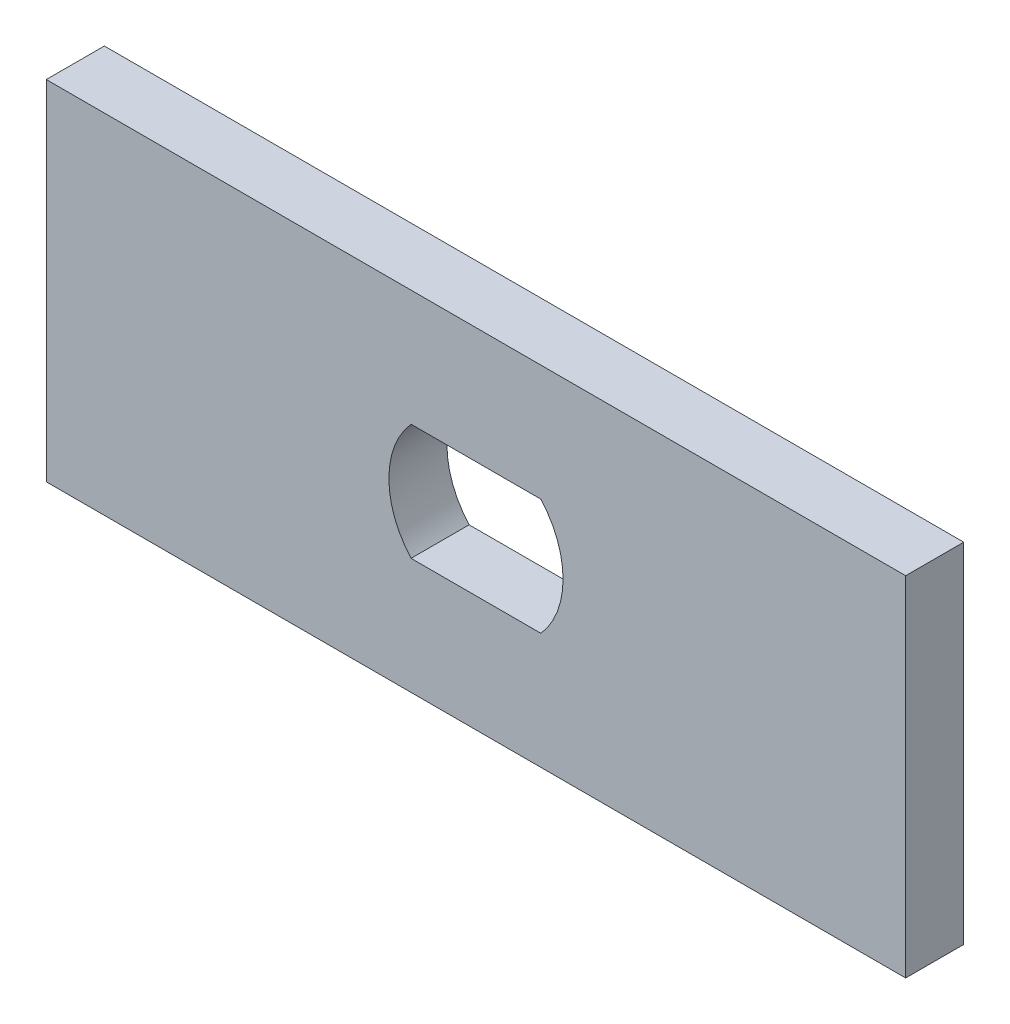
ISO-10303-21;
HEADER;
FILE_DESCRIPTION(('STEP AP214'),'2;1');
FILE_NAME('part.step','',(''),(''),'','','');
FILE_SCHEMA(('AUTOMOTIVE_DESIGN { 1 0 10303 214 1 1 1 1 }'));
ENDSEC;
DATA;
#1=APPLICATION_CONTEXT('core data for automotive mechanical design processes');
#2=APPLICATION_PROTOCOL_DEFINITION('international standard','automotive_design',2000,#1);
#3=PRODUCT_CONTEXT('',#1,'mechanical');
#4=PRODUCT('Part','Part','',(#3));
#5=PRODUCT_RELATED_PRODUCT_CATEGORY('part','',(#4));
#6=PRODUCT_DEFINITION_FORMATION('','',#4);
#7=PRODUCT_DEFINITION_CONTEXT('part definition',#1,'design');
#8=PRODUCT_DEFINITION('design','',#6,#7);
#9=PRODUCT_DEFINITION_SHAPE('','',#8);
#10=(LENGTH_UNIT() NAMED_UNIT(*) SI_UNIT(.MILLI.,.METRE.));
#11=(NAMED_UNIT(*) PLANE_ANGLE_UNIT() SI_UNIT($,.RADIAN.));
#12=(NAMED_UNIT(*) SI_UNIT($,.STERADIAN.) SOLID_ANGLE_UNIT());
#13=UNCERTAINTY_MEASURE_WITH_UNIT(LENGTH_MEASURE(1.E-05),#10,'distance_accuracy_value','');
#14=(GEOMETRIC_REPRESENTATION_CONTEXT(3) GLOBAL_UNCERTAINTY_ASSIGNED_CONTEXT((#13)) GLOBAL_UNIT_ASSIGNED_CONTEXT((#10,
#11,#12)) REPRESENTATION_CONTEXT('',''));
#15=CARTESIAN_POINT('',(0.,0.,0.));
#16=DIRECTION('',(0.,0.,1.));
#17=DIRECTION('',(1.,0.,0.));
#18=AXIS2_PLACEMENT_3D('',#15,#16,#17);
#19=CARTESIAN_POINT('',(0.,0.,6.35));
#20=DIRECTION('',(0.,0.,1.));
#21=DIRECTION('',(1.,0.,0.));
#22=AXIS2_PLACEMENT_3D('',#19,#20,#21);
#23=PLANE('',#22);
#24=DIRECTION('',(0.,1.,0.));
#25=VECTOR('',#24,1.);
#26=CARTESIAN_POINT('',(46.99,19.05,6.35));
#27=LINE('',#26,#25);
#28=CARTESIAN_POINT('',(46.99,-19.05,6.35));
#29=VERTEX_POINT('',#28);
#30=CARTESIAN_POINT('',(46.99,19.05,6.35));
#31=VERTEX_POINT('',#30);
#32=EDGE_CURVE('E163',#29,#31,#27,.T.);
#33=ORIENTED_EDGE('',*,*,#32,.T.);
#34=DIRECTION('',(-1.,0.,0.));
#35=VECTOR('',#34,1.);
#36=CARTESIAN_POINT('',(-46.99,19.05,6.35));
#37=LINE('',#36,#35);
#38=CARTESIAN_POINT('',(-46.99,19.05,6.35));
#39=VERTEX_POINT('',#38);
#40=EDGE_CURVE('E166',#31,#39,#37,.T.);
#41=ORIENTED_EDGE('',*,*,#40,.T.);
#42=DIRECTION('',(0.,-1.,0.));
#43=VECTOR('',#42,1.);
#44=CARTESIAN_POINT('',(-46.99,19.05,6.35));
#45=LINE('',#44,#43);
#46=CARTESIAN_POINT('',(-46.99,-19.05,6.35));
#47=VERTEX_POINT('',#46);
#48=EDGE_CURVE('E170',#39,#47,#45,.T.);
#49=ORIENTED_EDGE('',*,*,#48,.T.);
#50=DIRECTION('',(1.,0.,0.));
#51=VECTOR('',#50,1.);
#52=CARTESIAN_POINT('',(-46.99,-19.05,6.35));
#53=LINE('',#52,#51);
#54=EDGE_CURVE('E173',#47,#29,#53,.T.);
#55=ORIENTED_EDGE('',*,*,#54,.T.);
#56=EDGE_LOOP('',(#33,#41,#49,#55));
#57=FACE_BOUND('',#56,.T.);
#58=DIRECTION('',(-1.,0.,0.));
#59=VECTOR('',#58,1.);
#60=CARTESIAN_POINT('',(-7.09951582856185,6.35,6.35));
#61=LINE('',#60,#59);
#62=CARTESIAN_POINT('',(7.09951582856183,6.35,6.35));
#63=VERTEX_POINT('',#62);
#64=CARTESIAN_POINT('',(-7.09951582856185,6.35,6.35));
#65=VERTEX_POINT('',#64);
#66=EDGE_CURVE('E124',#63,#65,#61,.T.);
#67=ORIENTED_EDGE('',*,*,#66,.F.);
#68=CARTESIAN_POINT('',(0.,0.,6.35));
#69=DIRECTION('',(0.,0.,1.));
#70=DIRECTION('',(1.,0.,0.));
#71=AXIS2_PLACEMENT_3D('',#68,#69,#70);
#72=CIRCLE('',#71,9.52499999999999);
#73=CARTESIAN_POINT('',(7.09951582856183,-6.35,6.35));
#74=VERTEX_POINT('',#73);
#75=EDGE_CURVE('E115',#74,#63,#72,.T.);
#76=ORIENTED_EDGE('',*,*,#75,.F.);
#77=DIRECTION('',(1.,0.,0.));
#78=VECTOR('',#77,1.);
#79=CARTESIAN_POINT('',(-7.09951582856185,-6.35,6.35));
#80=LINE('',#79,#78);
#81=CARTESIAN_POINT('',(-7.09951582856184,-6.35,6.35));
#82=VERTEX_POINT('',#81);
#83=EDGE_CURVE('E142',#82,#74,#80,.T.);
#84=ORIENTED_EDGE('',*,*,#83,.F.);
#85=CARTESIAN_POINT('',(0.,0.,6.35));
#86=DIRECTION('',(0.,0.,1.));
#87=DIRECTION('',(1.,0.,0.));
#88=AXIS2_PLACEMENT_3D('',#85,#86,#87);
#89=CIRCLE('',#88,9.52500000000001);
#90=EDGE_CURVE('E137',#65,#82,#89,.T.);
#91=ORIENTED_EDGE('',*,*,#90,.F.);
#92=EDGE_LOOP('',(#67,#76,#84,#91));
#93=FACE_BOUND('',#92,.T.);
#94=ADVANCED_FACE('F40',(#57,#93),#23,.T.);
#95=CARTESIAN_POINT('',(0.,0.,0.));
#96=DIRECTION('',(0.,0.,1.));
#97=DIRECTION('',(1.,0.,0.));
#98=AXIS2_PLACEMENT_3D('',#95,#96,#97);
#99=PLANE('',#98);
#100=DIRECTION('',(0.,1.,0.));
#101=VECTOR('',#100,1.);
#102=CARTESIAN_POINT('',(46.99,19.05,0.));
#103=LINE('',#102,#101);
#104=CARTESIAN_POINT('',(46.99,-19.05,0.));
#105=VERTEX_POINT('',#104);
#106=CARTESIAN_POINT('',(46.99,19.05,0.));
#107=VERTEX_POINT('',#106);
#108=EDGE_CURVE('E133',#105,#107,#103,.T.);
#109=ORIENTED_EDGE('',*,*,#108,.F.);
#110=DIRECTION('',(1.,0.,0.));
#111=VECTOR('',#110,1.);
#112=CARTESIAN_POINT('',(-46.99,-19.05,0.));
#113=LINE('',#112,#111);
#114=CARTESIAN_POINT('',(-46.99,-19.05,0.));
#115=VERTEX_POINT('',#114);
#116=EDGE_CURVE('E167',#115,#105,#113,.T.);
#117=ORIENTED_EDGE('',*,*,#116,.F.);
#118=DIRECTION('',(0.,-1.,0.));
#119=VECTOR('',#118,1.);
#120=CARTESIAN_POINT('',(-46.99,19.05,0.));
#121=LINE('',#120,#119);
#122=CARTESIAN_POINT('',(-46.99,19.05,0.));
#123=VERTEX_POINT('',#122);
#124=EDGE_CURVE('E182',#123,#115,#121,.T.);
#125=ORIENTED_EDGE('',*,*,#124,.F.);
#126=DIRECTION('',(-1.,0.,0.));
#127=VECTOR('',#126,1.);
#128=CARTESIAN_POINT('',(-46.99,19.05,0.));
#129=LINE('',#128,#127);
#130=EDGE_CURVE('E179',#107,#123,#129,.T.);
#131=ORIENTED_EDGE('',*,*,#130,.F.);
#132=EDGE_LOOP('',(#109,#117,#125,#131));
#133=FACE_BOUND('',#132,.T.);
#134=CARTESIAN_POINT('',(0.,0.,0.));
#135=DIRECTION('',(0.,0.,1.));
#136=DIRECTION('',(1.,0.,0.));
#137=AXIS2_PLACEMENT_3D('',#134,#135,#136);
#138=CIRCLE('',#137,9.52499999999999);
#139=CARTESIAN_POINT('',(7.09951582856183,-6.35,0.));
#140=VERTEX_POINT('',#139);
#141=CARTESIAN_POINT('',(7.09951582856183,6.35,0.));
#142=VERTEX_POINT('',#141);
#143=EDGE_CURVE('E63',#140,#142,#138,.T.);
#144=ORIENTED_EDGE('',*,*,#143,.T.);
#145=DIRECTION('',(-1.,0.,0.));
#146=VECTOR('',#145,1.);
#147=CARTESIAN_POINT('',(-7.09951582856185,6.35,0.));
#148=LINE('',#147,#146);
#149=CARTESIAN_POINT('',(-7.09951582856185,6.35,0.));
#150=VERTEX_POINT('',#149);
#151=EDGE_CURVE('E131',#142,#150,#148,.T.);
#152=ORIENTED_EDGE('',*,*,#151,.T.);
#153=CARTESIAN_POINT('',(0.,0.,0.));
#154=DIRECTION('',(0.,0.,1.));
#155=DIRECTION('',(1.,0.,0.));
#156=AXIS2_PLACEMENT_3D('',#153,#154,#155);
#157=CIRCLE('',#156,9.52500000000001);
#158=CARTESIAN_POINT('',(-7.09951582856184,-6.35,0.));
#159=VERTEX_POINT('',#158);
#160=EDGE_CURVE('E150',#150,#159,#157,.T.);
#161=ORIENTED_EDGE('',*,*,#160,.T.);
#162=DIRECTION('',(1.,0.,0.));
#163=VECTOR('',#162,1.);
#164=CARTESIAN_POINT('',(-7.09951582856185,-6.35,0.));
#165=LINE('',#164,#163);
#166=EDGE_CURVE('E125',#159,#140,#165,.T.);
#167=ORIENTED_EDGE('',*,*,#166,.T.);
#168=EDGE_LOOP('',(#144,#152,#161,#167));
#169=FACE_BOUND('',#168,.T.);
#170=ADVANCED_FACE('F204',(#133,#169),#99,.F.);
#171=CARTESIAN_POINT('',(46.99,19.05,6.35));
#172=DIRECTION('',(-1.,0.,0.));
#173=DIRECTION('',(0.,-1.,0.));
#174=AXIS2_PLACEMENT_3D('',#171,#172,#173);
#175=PLANE('',#174);
#176=ORIENTED_EDGE('',*,*,#108,.T.);
#177=DIRECTION('',(0.,0.,-1.));
#178=VECTOR('',#177,1.);
#179=CARTESIAN_POINT('',(46.99,19.05,6.35));
#180=LINE('',#179,#178);
#181=EDGE_CURVE('E11',#31,#107,#180,.T.);
#182=ORIENTED_EDGE('',*,*,#181,.F.);
#183=ORIENTED_EDGE('',*,*,#32,.F.);
#184=DIRECTION('',(0.,0.,-1.));
#185=VECTOR('',#184,1.);
#186=CARTESIAN_POINT('',(46.99,-19.05,6.35));
#187=LINE('',#186,#185);
#188=EDGE_CURVE('E176',#29,#105,#187,.T.);
#189=ORIENTED_EDGE('',*,*,#188,.T.);
#190=EDGE_LOOP('',(#176,#182,#183,#189));
#191=FACE_BOUND('',#190,.T.);
#192=ADVANCED_FACE('F42',(#191),#175,.F.);
#193=CARTESIAN_POINT('',(-46.99,19.05,6.35));
#194=DIRECTION('',(0.,-1.,0.));
#195=DIRECTION('',(0.,0.,-1.));
#196=AXIS2_PLACEMENT_3D('',#193,#194,#195);
#197=PLANE('',#196);
#198=ORIENTED_EDGE('',*,*,#130,.T.);
#199=DIRECTION('',(0.,0.,-1.));
#200=VECTOR('',#199,1.);
#201=CARTESIAN_POINT('',(-46.99,19.05,6.35));
#202=LINE('',#201,#200);
#203=EDGE_CURVE('E48',#39,#123,#202,.T.);
#204=ORIENTED_EDGE('',*,*,#203,.F.);
#205=ORIENTED_EDGE('',*,*,#40,.F.);
#206=ORIENTED_EDGE('',*,*,#181,.T.);
#207=EDGE_LOOP('',(#198,#204,#205,#206));
#208=FACE_BOUND('',#207,.T.);
#209=ADVANCED_FACE('F214',(#208),#197,.F.);
#210=CARTESIAN_POINT('',(-46.99,19.05,6.35));
#211=DIRECTION('',(1.,0.,0.));
#212=DIRECTION('',(0.,1.,0.));
#213=AXIS2_PLACEMENT_3D('',#210,#211,#212);
#214=PLANE('',#213);
#215=ORIENTED_EDGE('',*,*,#124,.T.);
#216=DIRECTION('',(0.,0.,-1.));
#217=VECTOR('',#216,1.);
#218=CARTESIAN_POINT('',(-46.99,-19.05,6.35));
#219=LINE('',#218,#217);
#220=EDGE_CURVE('E189',#47,#115,#219,.T.);
#221=ORIENTED_EDGE('',*,*,#220,.F.);
#222=ORIENTED_EDGE('',*,*,#48,.F.);
#223=ORIENTED_EDGE('',*,*,#203,.T.);
#224=EDGE_LOOP('',(#215,#221,#222,#223));
#225=FACE_BOUND('',#224,.T.);
#226=ADVANCED_FACE('F198',(#225),#214,.F.);
#227=CARTESIAN_POINT('',(-46.99,-19.05,6.35));
#228=DIRECTION('',(0.,1.,0.));
#229=DIRECTION('',(-1.,0.,0.));
#230=AXIS2_PLACEMENT_3D('',#227,#228,#229);
#231=PLANE('',#230);
#232=ORIENTED_EDGE('',*,*,#116,.T.);
#233=ORIENTED_EDGE('',*,*,#188,.F.);
#234=ORIENTED_EDGE('',*,*,#54,.F.);
#235=ORIENTED_EDGE('',*,*,#220,.T.);
#236=EDGE_LOOP('',(#232,#233,#234,#235));
#237=FACE_BOUND('',#236,.T.);
#238=ADVANCED_FACE('F208',(#237),#231,.F.);
#239=CARTESIAN_POINT('',(0.,0.,6.35));
#240=DIRECTION('',(0.,0.,-1.));
#241=DIRECTION('',(-1.,0.,0.));
#242=AXIS2_PLACEMENT_3D('',#239,#240,#241);
#243=CYLINDRICAL_SURFACE('',#242,9.52499999999999);
#244=ORIENTED_EDGE('',*,*,#143,.F.);
#245=DIRECTION('',(0.,0.,-1.));
#246=VECTOR('',#245,1.);
#247=CARTESIAN_POINT('',(7.09951582856183,-6.35,6.35));
#248=LINE('',#247,#246);
#249=EDGE_CURVE('E119',#74,#140,#248,.T.);
#250=ORIENTED_EDGE('',*,*,#249,.F.);
#251=ORIENTED_EDGE('',*,*,#75,.T.);
#252=DIRECTION('',(0.,0.,-1.));
#253=VECTOR('',#252,1.);
#254=CARTESIAN_POINT('',(7.09951582856183,6.35,6.35));
#255=LINE('',#254,#253);
#256=EDGE_CURVE('E118',#63,#142,#255,.T.);
#257=ORIENTED_EDGE('',*,*,#256,.T.);
#258=EDGE_LOOP('',(#244,#250,#251,#257));
#259=FACE_BOUND('',#258,.T.);
#260=ADVANCED_FACE('F117',(#259),#243,.F.);
#261=CARTESIAN_POINT('',(-7.09951582856185,6.35,6.35));
#262=DIRECTION('',(0.,-1.,0.));
#263=DIRECTION('',(0.,0.,-1.));
#264=AXIS2_PLACEMENT_3D('',#261,#262,#263);
#265=PLANE('',#264);
#266=ORIENTED_EDGE('',*,*,#151,.F.);
#267=ORIENTED_EDGE('',*,*,#256,.F.);
#268=ORIENTED_EDGE('',*,*,#66,.T.);
#269=DIRECTION('',(0.,0.,-1.));
#270=VECTOR('',#269,1.);
#271=CARTESIAN_POINT('',(-7.09951582856185,6.35,6.35));
#272=LINE('',#271,#270);
#273=EDGE_CURVE('E134',#65,#150,#272,.T.);
#274=ORIENTED_EDGE('',*,*,#273,.T.);
#275=EDGE_LOOP('',(#266,#267,#268,#274));
#276=FACE_BOUND('',#275,.T.);
#277=ADVANCED_FACE('F128',(#276),#265,.T.);
#278=CARTESIAN_POINT('',(0.,0.,6.35));
#279=DIRECTION('',(0.,0.,-1.));
#280=DIRECTION('',(-1.,0.,0.));
#281=AXIS2_PLACEMENT_3D('',#278,#279,#280);
#282=CYLINDRICAL_SURFACE('',#281,9.52500000000001);
#283=ORIENTED_EDGE('',*,*,#160,.F.);
#284=ORIENTED_EDGE('',*,*,#273,.F.);
#285=ORIENTED_EDGE('',*,*,#90,.T.);
#286=DIRECTION('',(0.,0.,-1.));
#287=VECTOR('',#286,1.);
#288=CARTESIAN_POINT('',(-7.09951582856184,-6.35,6.35));
#289=LINE('',#288,#287);
#290=EDGE_CURVE('E55',#82,#159,#289,.T.);
#291=ORIENTED_EDGE('',*,*,#290,.T.);
#292=EDGE_LOOP('',(#283,#284,#285,#291));
#293=FACE_BOUND('',#292,.T.);
#294=ADVANCED_FACE('F237',(#293),#282,.F.);
#295=CARTESIAN_POINT('',(-7.09951582856185,-6.35,6.35));
#296=DIRECTION('',(0.,1.,0.));
#297=DIRECTION('',(0.,0.,1.));
#298=AXIS2_PLACEMENT_3D('',#295,#296,#297);
#299=PLANE('',#298);
#300=ORIENTED_EDGE('',*,*,#166,.F.);
#301=ORIENTED_EDGE('',*,*,#290,.F.);
#302=ORIENTED_EDGE('',*,*,#83,.T.);
#303=ORIENTED_EDGE('',*,*,#249,.T.);
#304=EDGE_LOOP('',(#300,#301,#302,#303));
#305=FACE_BOUND('',#304,.T.);
#306=ADVANCED_FACE('F241',(#305),#299,.T.);
#307=CLOSED_SHELL('',(#94,#170,#192,#209,#226,#238,#260,#277,#294,#306));
#308=MANIFOLD_SOLID_BREP('B2',#307);
#309=ADVANCED_BREP_SHAPE_REPRESENTATION('',(#18,#308),#14);
#310=SHAPE_DEFINITION_REPRESENTATION(#9,#309);
ENDSEC;
END-ISO-10303-21;
